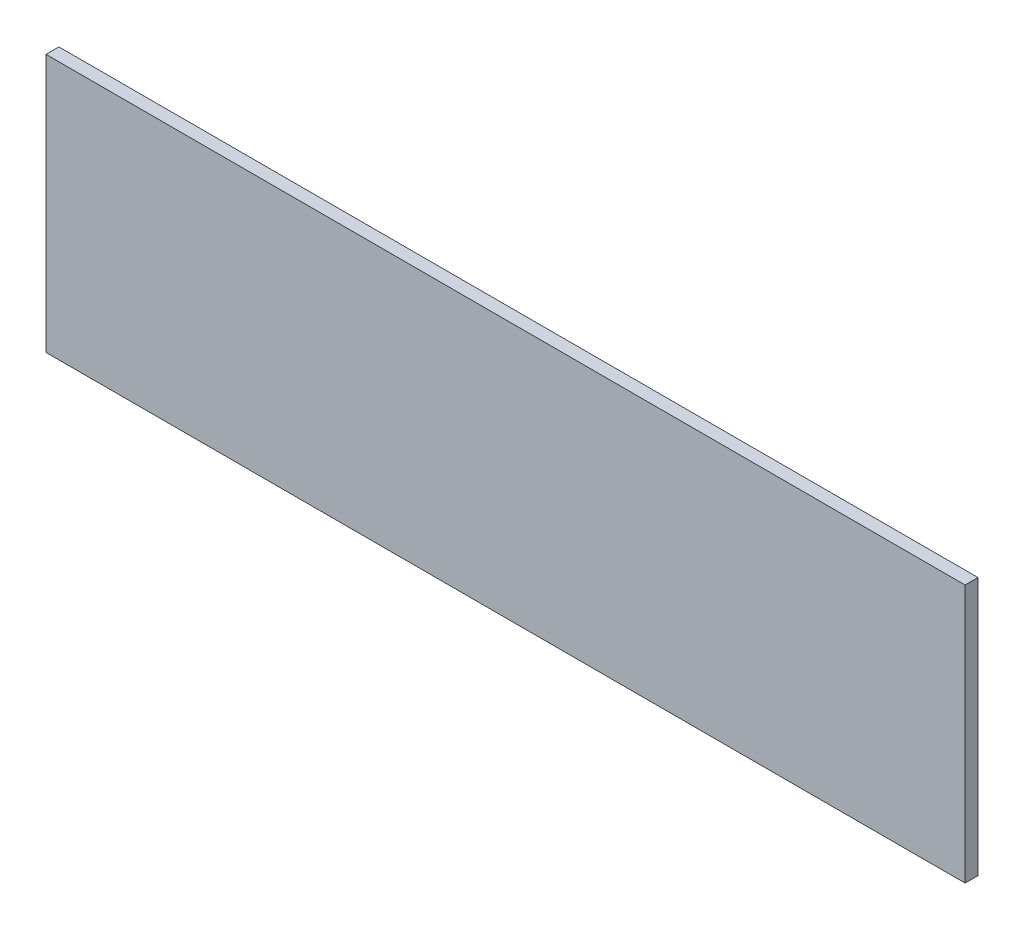
ISO-10303-21;
HEADER;
FILE_DESCRIPTION(('STEP AP214'),'2;1');
FILE_NAME('part.step','',(''),(''),'','','');
FILE_SCHEMA(('AUTOMOTIVE_DESIGN { 1 0 10303 214 1 1 1 1 }'));
ENDSEC;
DATA;
#1=APPLICATION_CONTEXT('core data for automotive mechanical design processes');
#2=APPLICATION_PROTOCOL_DEFINITION('international standard','automotive_design',2000,#1);
#3=PRODUCT_CONTEXT('',#1,'mechanical');
#4=PRODUCT('Part','Part','',(#3));
#5=PRODUCT_RELATED_PRODUCT_CATEGORY('part','',(#4));
#6=PRODUCT_DEFINITION_FORMATION('','',#4);
#7=PRODUCT_DEFINITION_CONTEXT('part definition',#1,'design');
#8=PRODUCT_DEFINITION('design','',#6,#7);
#9=PRODUCT_DEFINITION_SHAPE('','',#8);
#10=(LENGTH_UNIT() NAMED_UNIT(*) SI_UNIT(.MILLI.,.METRE.));
#11=(NAMED_UNIT(*) PLANE_ANGLE_UNIT() SI_UNIT($,.RADIAN.));
#12=(NAMED_UNIT(*) SI_UNIT($,.STERADIAN.) SOLID_ANGLE_UNIT());
#13=UNCERTAINTY_MEASURE_WITH_UNIT(LENGTH_MEASURE(1.E-05),#10,'distance_accuracy_value','');
#14=(GEOMETRIC_REPRESENTATION_CONTEXT(3) GLOBAL_UNCERTAINTY_ASSIGNED_CONTEXT((#13)) GLOBAL_UNIT_ASSIGNED_CONTEXT((#10,
#11,#12)) REPRESENTATION_CONTEXT('',''));
#15=CARTESIAN_POINT('',(0.,0.,0.));
#16=DIRECTION('',(0.,0.,1.));
#17=DIRECTION('',(1.,0.,0.));
#18=AXIS2_PLACEMENT_3D('',#15,#16,#17);
#19=CARTESIAN_POINT('',(-356.,100.,5.));
#20=DIRECTION('',(1.,0.,0.));
#21=DIRECTION('',(0.,0.,-1.));
#22=AXIS2_PLACEMENT_3D('',#19,#20,#21);
#23=PLANE('',#22);
#24=DIRECTION('',(0.,-1.,0.));
#25=VECTOR('',#24,1.);
#26=CARTESIAN_POINT('',(-356.,100.,0.));
#27=LINE('',#26,#25);
#28=CARTESIAN_POINT('',(-356.,100.,0.));
#29=VERTEX_POINT('',#28);
#30=CARTESIAN_POINT('',(-356.,0.,0.));
#31=VERTEX_POINT('',#30);
#32=EDGE_CURVE('E98',#29,#31,#27,.T.);
#33=ORIENTED_EDGE('',*,*,#32,.T.);
#34=DIRECTION('',(0.,0.,-1.));
#35=VECTOR('',#34,1.);
#36=CARTESIAN_POINT('',(-356.,0.,5.));
#37=LINE('',#36,#35);
#38=CARTESIAN_POINT('',(-356.,0.,5.));
#39=VERTEX_POINT('',#38);
#40=EDGE_CURVE('E11',#39,#31,#37,.T.);
#41=ORIENTED_EDGE('',*,*,#40,.F.);
#42=DIRECTION('',(0.,-1.,0.));
#43=VECTOR('',#42,1.);
#44=CARTESIAN_POINT('',(-356.,100.,5.));
#45=LINE('',#44,#43);
#46=CARTESIAN_POINT('',(-356.,100.,5.));
#47=VERTEX_POINT('',#46);
#48=EDGE_CURVE('E86',#47,#39,#45,.T.);
#49=ORIENTED_EDGE('',*,*,#48,.F.);
#50=DIRECTION('',(0.,0.,-1.));
#51=VECTOR('',#50,1.);
#52=CARTESIAN_POINT('',(-356.,100.,5.));
#53=LINE('',#52,#51);
#54=EDGE_CURVE('E94',#47,#29,#53,.T.);
#55=ORIENTED_EDGE('',*,*,#54,.T.);
#56=EDGE_LOOP('',(#33,#41,#49,#55));
#57=FACE_BOUND('',#56,.T.);
#58=ADVANCED_FACE('F35',(#57),#23,.F.);
#59=CARTESIAN_POINT('',(-356.,0.,5.));
#60=DIRECTION('',(0.,1.,0.));
#61=DIRECTION('',(0.,0.,1.));
#62=AXIS2_PLACEMENT_3D('',#59,#60,#61);
#63=PLANE('',#62);
#64=DIRECTION('',(1.,0.,0.));
#65=VECTOR('',#64,1.);
#66=CARTESIAN_POINT('',(-356.,0.,0.));
#67=LINE('',#66,#65);
#68=CARTESIAN_POINT('',(0.,0.,0.));
#69=VERTEX_POINT('',#68);
#70=EDGE_CURVE('E90',#31,#69,#67,.T.);
#71=ORIENTED_EDGE('',*,*,#70,.T.);
#72=DIRECTION('',(0.,0.,-1.));
#73=VECTOR('',#72,1.);
#74=CARTESIAN_POINT('',(0.,0.,5.));
#75=LINE('',#74,#73);
#76=CARTESIAN_POINT('',(0.,0.,5.));
#77=VERTEX_POINT('',#76);
#78=EDGE_CURVE('E43',#77,#69,#75,.T.);
#79=ORIENTED_EDGE('',*,*,#78,.F.);
#80=DIRECTION('',(1.,0.,0.));
#81=VECTOR('',#80,1.);
#82=CARTESIAN_POINT('',(-356.,0.,5.));
#83=LINE('',#82,#81);
#84=EDGE_CURVE('E81',#39,#77,#83,.T.);
#85=ORIENTED_EDGE('',*,*,#84,.F.);
#86=ORIENTED_EDGE('',*,*,#40,.T.);
#87=EDGE_LOOP('',(#71,#79,#85,#86));
#88=FACE_BOUND('',#87,.T.);
#89=ADVANCED_FACE('F89',(#88),#63,.F.);
#90=CARTESIAN_POINT('',(0.,100.,5.));
#91=DIRECTION('',(-1.,0.,0.));
#92=DIRECTION('',(0.,-1.,0.));
#93=AXIS2_PLACEMENT_3D('',#90,#91,#92);
#94=PLANE('',#93);
#95=DIRECTION('',(0.,1.,0.));
#96=VECTOR('',#95,1.);
#97=CARTESIAN_POINT('',(0.,100.,0.));
#98=LINE('',#97,#96);
#99=CARTESIAN_POINT('',(0.,100.,0.));
#100=VERTEX_POINT('',#99);
#101=EDGE_CURVE('E68',#69,#100,#98,.T.);
#102=ORIENTED_EDGE('',*,*,#101,.T.);
#103=DIRECTION('',(0.,0.,-1.));
#104=VECTOR('',#103,1.);
#105=CARTESIAN_POINT('',(0.,100.,5.));
#106=LINE('',#105,#104);
#107=CARTESIAN_POINT('',(0.,100.,5.));
#108=VERTEX_POINT('',#107);
#109=EDGE_CURVE('E91',#108,#100,#106,.T.);
#110=ORIENTED_EDGE('',*,*,#109,.F.);
#111=DIRECTION('',(0.,1.,0.));
#112=VECTOR('',#111,1.);
#113=CARTESIAN_POINT('',(0.,100.,5.));
#114=LINE('',#113,#112);
#115=EDGE_CURVE('E84',#77,#108,#114,.T.);
#116=ORIENTED_EDGE('',*,*,#115,.F.);
#117=ORIENTED_EDGE('',*,*,#78,.T.);
#118=EDGE_LOOP('',(#102,#110,#116,#117));
#119=FACE_BOUND('',#118,.T.);
#120=ADVANCED_FACE('F92',(#119),#94,.F.);
#121=CARTESIAN_POINT('',(-356.,100.,5.));
#122=DIRECTION('',(0.,-1.,0.));
#123=DIRECTION('',(1.,0.,0.));
#124=AXIS2_PLACEMENT_3D('',#121,#122,#123);
#125=PLANE('',#124);
#126=DIRECTION('',(-1.,0.,0.));
#127=VECTOR('',#126,1.);
#128=CARTESIAN_POINT('',(-356.,100.,0.));
#129=LINE('',#128,#127);
#130=EDGE_CURVE('E74',#100,#29,#129,.T.);
#131=ORIENTED_EDGE('',*,*,#130,.T.);
#132=ORIENTED_EDGE('',*,*,#54,.F.);
#133=DIRECTION('',(-1.,0.,0.));
#134=VECTOR('',#133,1.);
#135=CARTESIAN_POINT('',(-356.,100.,5.));
#136=LINE('',#135,#134);
#137=EDGE_CURVE('E51',#108,#47,#136,.T.);
#138=ORIENTED_EDGE('',*,*,#137,.F.);
#139=ORIENTED_EDGE('',*,*,#109,.T.);
#140=EDGE_LOOP('',(#131,#132,#138,#139));
#141=FACE_BOUND('',#140,.T.);
#142=ADVANCED_FACE('F105',(#141),#125,.F.);
#143=CARTESIAN_POINT('',(0.,0.,5.));
#144=DIRECTION('',(0.,0.,1.));
#145=DIRECTION('',(1.,0.,0.));
#146=AXIS2_PLACEMENT_3D('',#143,#144,#145);
#147=PLANE('',#146);
#148=ORIENTED_EDGE('',*,*,#48,.T.);
#149=ORIENTED_EDGE('',*,*,#84,.T.);
#150=ORIENTED_EDGE('',*,*,#115,.T.);
#151=ORIENTED_EDGE('',*,*,#137,.T.);
#152=EDGE_LOOP('',(#148,#149,#150,#151));
#153=FACE_BOUND('',#152,.T.);
#154=ADVANCED_FACE('F82',(#153),#147,.T.);
#155=CARTESIAN_POINT('',(0.,0.,0.));
#156=DIRECTION('',(0.,0.,1.));
#157=DIRECTION('',(1.,0.,0.));
#158=AXIS2_PLACEMENT_3D('',#155,#156,#157);
#159=PLANE('',#158);
#160=ORIENTED_EDGE('',*,*,#32,.F.);
#161=ORIENTED_EDGE('',*,*,#130,.F.);
#162=ORIENTED_EDGE('',*,*,#101,.F.);
#163=ORIENTED_EDGE('',*,*,#70,.F.);
#164=EDGE_LOOP('',(#160,#161,#162,#163));
#165=FACE_BOUND('',#164,.T.);
#166=ADVANCED_FACE('F108',(#165),#159,.F.);
#167=CLOSED_SHELL('',(#58,#89,#120,#142,#154,#166));
#168=MANIFOLD_SOLID_BREP('B2',#167);
#169=ADVANCED_BREP_SHAPE_REPRESENTATION('',(#18,#168),#14);
#170=SHAPE_DEFINITION_REPRESENTATION(#9,#169);
ENDSEC;
END-ISO-10303-21;
